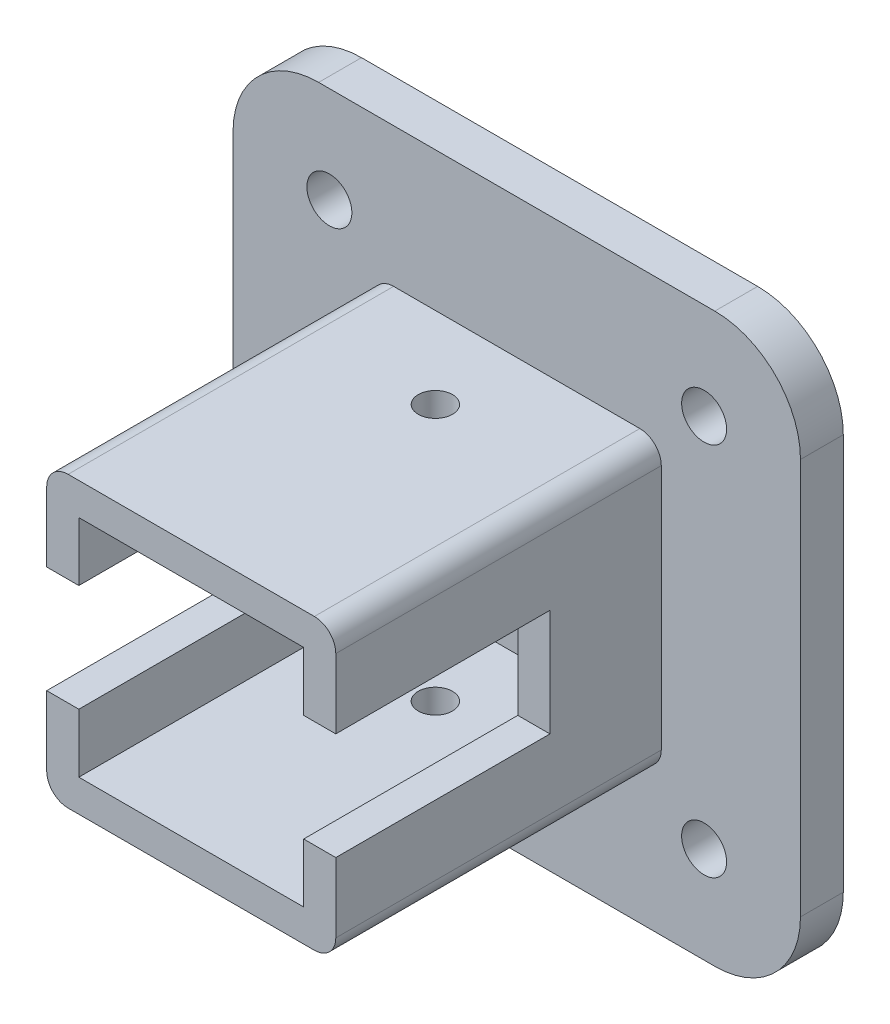
ISO-10303-21;
HEADER;
FILE_DESCRIPTION(('STEP AP214'),'2;1');
FILE_NAME('part.step','',(''),(''),'','','');
FILE_SCHEMA(('AUTOMOTIVE_DESIGN { 1 0 10303 214 1 1 1 1 }'));
ENDSEC;
DATA;
#1=APPLICATION_CONTEXT('core data for automotive mechanical design processes');
#2=APPLICATION_PROTOCOL_DEFINITION('international standard','automotive_design',2000,#1);
#3=PRODUCT_CONTEXT('',#1,'mechanical');
#4=PRODUCT('Part','Part','',(#3));
#5=PRODUCT_RELATED_PRODUCT_CATEGORY('part','',(#4));
#6=PRODUCT_DEFINITION_FORMATION('','',#4);
#7=PRODUCT_DEFINITION_CONTEXT('part definition',#1,'design');
#8=PRODUCT_DEFINITION('design','',#6,#7);
#9=PRODUCT_DEFINITION_SHAPE('','',#8);
#10=(LENGTH_UNIT() NAMED_UNIT(*) SI_UNIT(.MILLI.,.METRE.));
#11=(NAMED_UNIT(*) PLANE_ANGLE_UNIT() SI_UNIT($,.RADIAN.));
#12=(NAMED_UNIT(*) SI_UNIT($,.STERADIAN.) SOLID_ANGLE_UNIT());
#13=UNCERTAINTY_MEASURE_WITH_UNIT(LENGTH_MEASURE(1.E-05),#10,'distance_accuracy_value','');
#14=(GEOMETRIC_REPRESENTATION_CONTEXT(3) GLOBAL_UNCERTAINTY_ASSIGNED_CONTEXT((#13)) GLOBAL_UNIT_ASSIGNED_CONTEXT((#10,
#11,#12)) REPRESENTATION_CONTEXT('',''));
#15=CARTESIAN_POINT('',(0.,0.,0.));
#16=DIRECTION('',(0.,0.,1.));
#17=DIRECTION('',(1.,0.,0.));
#18=AXIS2_PLACEMENT_3D('',#15,#16,#17);
#19=CARTESIAN_POINT('',(0.,0.,30.4));
#20=DIRECTION('',(0.,0.,1.));
#21=DIRECTION('',(1.,0.,0.));
#22=AXIS2_PLACEMENT_3D('',#19,#20,#21);
#23=PLANE('',#22);
#24=DIRECTION('',(-1.,0.,0.));
#25=VECTOR('',#24,1.);
#26=CARTESIAN_POINT('',(0.,5.,30.4));
#27=LINE('',#26,#25);
#28=CARTESIAN_POINT('',(13.5,5.,30.4));
#29=VERTEX_POINT('',#28);
#30=CARTESIAN_POINT('',(10.5,5.,30.4));
#31=VERTEX_POINT('',#30);
#32=EDGE_CURVE('E45',#29,#31,#27,.T.);
#33=ORIENTED_EDGE('',*,*,#32,.F.);
#34=DIRECTION('',(0.,1.,0.));
#35=VECTOR('',#34,1.);
#36=CARTESIAN_POINT('',(13.5,0.,30.4));
#37=LINE('',#36,#35);
#38=CARTESIAN_POINT('',(13.5,11.5,30.4));
#39=VERTEX_POINT('',#38);
#40=EDGE_CURVE('E248',#29,#39,#37,.T.);
#41=ORIENTED_EDGE('',*,*,#40,.T.);
#42=CARTESIAN_POINT('',(11.5,11.5,30.4));
#43=DIRECTION('',(0.,0.,1.));
#44=DIRECTION('',(1.,0.,0.));
#45=AXIS2_PLACEMENT_3D('',#42,#43,#44);
#46=CIRCLE('',#45,2.);
#47=CARTESIAN_POINT('',(11.5,13.5,30.4));
#48=VERTEX_POINT('',#47);
#49=EDGE_CURVE('E247',#39,#48,#46,.T.);
#50=ORIENTED_EDGE('',*,*,#49,.T.);
#51=DIRECTION('',(-1.,0.,0.));
#52=VECTOR('',#51,1.);
#53=CARTESIAN_POINT('',(0.,13.5,30.4));
#54=LINE('',#53,#52);
#55=CARTESIAN_POINT('',(-11.5,13.5,30.4));
#56=VERTEX_POINT('',#55);
#57=EDGE_CURVE('E251',#48,#56,#54,.T.);
#58=ORIENTED_EDGE('',*,*,#57,.T.);
#59=CARTESIAN_POINT('',(-11.5,11.5,30.4));
#60=DIRECTION('',(0.,0.,1.));
#61=DIRECTION('',(1.,0.,0.));
#62=AXIS2_PLACEMENT_3D('',#59,#60,#61);
#63=CIRCLE('',#62,2.);
#64=CARTESIAN_POINT('',(-13.5,11.5,30.4));
#65=VERTEX_POINT('',#64);
#66=EDGE_CURVE('E443',#56,#65,#63,.T.);
#67=ORIENTED_EDGE('',*,*,#66,.T.);
#68=DIRECTION('',(0.,-1.,0.));
#69=VECTOR('',#68,1.);
#70=CARTESIAN_POINT('',(-13.5,0.,30.4));
#71=LINE('',#70,#69);
#72=CARTESIAN_POINT('',(-13.5,5.,30.4));
#73=VERTEX_POINT('',#72);
#74=EDGE_CURVE('E451',#65,#73,#71,.T.);
#75=ORIENTED_EDGE('',*,*,#74,.T.);
#76=CARTESIAN_POINT('',(-10.5,5.,30.4));
#77=VERTEX_POINT('',#76);
#78=EDGE_CURVE('E418',#77,#73,#27,.T.);
#79=ORIENTED_EDGE('',*,*,#78,.F.);
#80=DIRECTION('',(0.,1.,0.));
#81=VECTOR('',#80,1.);
#82=CARTESIAN_POINT('',(-10.5,0.,30.4));
#83=LINE('',#82,#81);
#84=CARTESIAN_POINT('',(-10.5,10.5,30.4));
#85=VERTEX_POINT('',#84);
#86=EDGE_CURVE('E440',#77,#85,#83,.T.);
#87=ORIENTED_EDGE('',*,*,#86,.T.);
#88=DIRECTION('',(1.,0.,0.));
#89=VECTOR('',#88,1.);
#90=CARTESIAN_POINT('',(0.,10.5,30.4));
#91=LINE('',#90,#89);
#92=CARTESIAN_POINT('',(10.5,10.5,30.4));
#93=VERTEX_POINT('',#92);
#94=EDGE_CURVE('E439',#85,#93,#91,.T.);
#95=ORIENTED_EDGE('',*,*,#94,.T.);
#96=DIRECTION('',(0.,-1.,0.));
#97=VECTOR('',#96,1.);
#98=CARTESIAN_POINT('',(10.5,0.,30.4));
#99=LINE('',#98,#97);
#100=EDGE_CURVE('E497',#93,#31,#99,.T.);
#101=ORIENTED_EDGE('',*,*,#100,.T.);
#102=EDGE_LOOP('',(#33,#41,#50,#58,#67,#75,#79,#87,#95,#101));
#103=FACE_BOUND('',#102,.T.);
#104=ADVANCED_FACE('F37',(#103),#23,.T.);
#105=CARTESIAN_POINT('',(13.5,-13.5,15.2));
#106=DIRECTION('',(-1.,0.,0.));
#107=DIRECTION('',(0.,0.,1.));
#108=AXIS2_PLACEMENT_3D('',#105,#106,#107);
#109=PLANE('',#108);
#110=ORIENTED_EDGE('',*,*,#40,.F.);
#111=DIRECTION('',(0.,0.,1.));
#112=VECTOR('',#111,1.);
#113=CARTESIAN_POINT('',(13.5,5.,30.4));
#114=LINE('',#113,#112);
#115=CARTESIAN_POINT('',(13.5,5.,10.4));
#116=VERTEX_POINT('',#115);
#117=EDGE_CURVE('E518',#116,#29,#114,.T.);
#118=ORIENTED_EDGE('',*,*,#117,.F.);
#119=DIRECTION('',(0.,1.,0.));
#120=VECTOR('',#119,1.);
#121=CARTESIAN_POINT('',(13.5,5.,10.4));
#122=LINE('',#121,#120);
#123=CARTESIAN_POINT('',(13.5,-5.,10.4));
#124=VERTEX_POINT('',#123);
#125=EDGE_CURVE('E240',#124,#116,#122,.T.);
#126=ORIENTED_EDGE('',*,*,#125,.F.);
#127=DIRECTION('',(0.,0.,-1.));
#128=VECTOR('',#127,1.);
#129=CARTESIAN_POINT('',(13.5,-5.,30.4));
#130=LINE('',#129,#128);
#131=CARTESIAN_POINT('',(13.5,-5.,30.4));
#132=VERTEX_POINT('',#131);
#133=EDGE_CURVE('E224',#132,#124,#130,.T.);
#134=ORIENTED_EDGE('',*,*,#133,.F.);
#135=CARTESIAN_POINT('',(13.5,-11.5,30.4));
#136=VERTEX_POINT('',#135);
#137=EDGE_CURVE('E237',#136,#132,#37,.T.);
#138=ORIENTED_EDGE('',*,*,#137,.F.);
#139=DIRECTION('',(0.,0.,-1.));
#140=VECTOR('',#139,1.);
#141=CARTESIAN_POINT('',(13.5,-11.5,15.2));
#142=LINE('',#141,#140);
#143=CARTESIAN_POINT('',(13.5,-11.5,0.));
#144=VERTEX_POINT('',#143);
#145=EDGE_CURVE('E407',#136,#144,#142,.T.);
#146=ORIENTED_EDGE('',*,*,#145,.T.);
#147=DIRECTION('',(0.,1.,0.));
#148=VECTOR('',#147,1.);
#149=CARTESIAN_POINT('',(13.5,-13.5,0.));
#150=LINE('',#149,#148);
#151=CARTESIAN_POINT('',(13.5,11.5,0.));
#152=VERTEX_POINT('',#151);
#153=EDGE_CURVE('E377',#144,#152,#150,.T.);
#154=ORIENTED_EDGE('',*,*,#153,.T.);
#155=DIRECTION('',(0.,0.,-1.));
#156=VECTOR('',#155,1.);
#157=CARTESIAN_POINT('',(13.5,11.5,15.2));
#158=LINE('',#157,#156);
#159=EDGE_CURVE('E409',#152,#39,#158,.F.);
#160=ORIENTED_EDGE('',*,*,#159,.T.);
#161=EDGE_LOOP('',(#110,#118,#126,#134,#138,#146,#154,#160));
#162=FACE_BOUND('',#161,.T.);
#163=ADVANCED_FACE('F235',(#162),#109,.F.);
#164=CARTESIAN_POINT('',(13.5,13.5,15.2));
#165=DIRECTION('',(0.,-1.,0.));
#166=DIRECTION('',(1.,0.,0.));
#167=AXIS2_PLACEMENT_3D('',#164,#165,#166);
#168=PLANE('',#167);
#169=CARTESIAN_POINT('',(0.,13.5,7.6));
#170=DIRECTION('',(0.,-1.,0.));
#171=DIRECTION('',(1.,0.,0.));
#172=AXIS2_PLACEMENT_3D('',#169,#170,#171);
#173=CIRCLE('',#172,1.6);
#174=CARTESIAN_POINT('',(1.6,13.5,7.6));
#175=VERTEX_POINT('',#174);
#176=EDGE_CURVE('E347',#175,#175,#173,.T.);
#177=ORIENTED_EDGE('',*,*,#176,.T.);
#178=EDGE_LOOP('',(#177));
#179=FACE_BOUND('',#178,.T.);
#180=DIRECTION('',(-1.,0.,0.));
#181=VECTOR('',#180,1.);
#182=CARTESIAN_POINT('',(13.5,13.5,0.));
#183=LINE('',#182,#181);
#184=CARTESIAN_POINT('',(11.5,13.5,0.));
#185=VERTEX_POINT('',#184);
#186=CARTESIAN_POINT('',(-11.5,13.5,0.));
#187=VERTEX_POINT('',#186);
#188=EDGE_CURVE('E380',#185,#187,#183,.T.);
#189=ORIENTED_EDGE('',*,*,#188,.T.);
#190=DIRECTION('',(0.,0.,-1.));
#191=VECTOR('',#190,1.);
#192=CARTESIAN_POINT('',(-11.5,13.5,15.2));
#193=LINE('',#192,#191);
#194=EDGE_CURVE('E405',#187,#56,#193,.F.);
#195=ORIENTED_EDGE('',*,*,#194,.T.);
#196=ORIENTED_EDGE('',*,*,#57,.F.);
#197=DIRECTION('',(0.,0.,-1.));
#198=VECTOR('',#197,1.);
#199=CARTESIAN_POINT('',(11.5,13.5,15.2));
#200=LINE('',#199,#198);
#201=EDGE_CURVE('E402',#48,#185,#200,.T.);
#202=ORIENTED_EDGE('',*,*,#201,.T.);
#203=EDGE_LOOP('',(#189,#195,#196,#202));
#204=FACE_BOUND('',#203,.T.);
#205=ADVANCED_FACE('F474',(#179,#204),#168,.F.);
#206=CARTESIAN_POINT('',(-13.5,-13.5,15.2));
#207=DIRECTION('',(1.,0.,0.));
#208=DIRECTION('',(0.,0.,-1.));
#209=AXIS2_PLACEMENT_3D('',#206,#207,#208);
#210=PLANE('',#209);
#211=DIRECTION('',(0.,1.,0.));
#212=VECTOR('',#211,1.);
#213=CARTESIAN_POINT('',(-13.5,-13.5,10.4));
#214=LINE('',#213,#212);
#215=CARTESIAN_POINT('',(-13.5,-5.,10.4));
#216=VERTEX_POINT('',#215);
#217=CARTESIAN_POINT('',(-13.5,5.,10.4));
#218=VERTEX_POINT('',#217);
#219=EDGE_CURVE('E505',#216,#218,#214,.T.);
#220=ORIENTED_EDGE('',*,*,#219,.T.);
#221=DIRECTION('',(0.,0.,1.));
#222=VECTOR('',#221,1.);
#223=CARTESIAN_POINT('',(-13.5,5.,15.2));
#224=LINE('',#223,#222);
#225=EDGE_CURVE('E486',#218,#73,#224,.T.);
#226=ORIENTED_EDGE('',*,*,#225,.T.);
#227=ORIENTED_EDGE('',*,*,#74,.F.);
#228=DIRECTION('',(0.,0.,-1.));
#229=VECTOR('',#228,1.);
#230=CARTESIAN_POINT('',(-13.5,11.5,15.2));
#231=LINE('',#230,#229);
#232=CARTESIAN_POINT('',(-13.5,11.5,0.));
#233=VERTEX_POINT('',#232);
#234=EDGE_CURVE('E396',#65,#233,#231,.T.);
#235=ORIENTED_EDGE('',*,*,#234,.T.);
#236=DIRECTION('',(0.,-1.,0.));
#237=VECTOR('',#236,1.);
#238=CARTESIAN_POINT('',(-13.5,-13.5,0.));
#239=LINE('',#238,#237);
#240=CARTESIAN_POINT('',(-13.5,-11.5,0.));
#241=VERTEX_POINT('',#240);
#242=EDGE_CURVE('E383',#233,#241,#239,.T.);
#243=ORIENTED_EDGE('',*,*,#242,.T.);
#244=DIRECTION('',(0.,0.,-1.));
#245=VECTOR('',#244,1.);
#246=CARTESIAN_POINT('',(-13.5,-11.5,15.2));
#247=LINE('',#246,#245);
#248=CARTESIAN_POINT('',(-13.5,-11.5,30.4));
#249=VERTEX_POINT('',#248);
#250=EDGE_CURVE('E399',#241,#249,#247,.F.);
#251=ORIENTED_EDGE('',*,*,#250,.T.);
#252=CARTESIAN_POINT('',(-13.5,-5.,30.4));
#253=VERTEX_POINT('',#252);
#254=EDGE_CURVE('E450',#253,#249,#71,.T.);
#255=ORIENTED_EDGE('',*,*,#254,.F.);
#256=DIRECTION('',(0.,0.,-1.));
#257=VECTOR('',#256,1.);
#258=CARTESIAN_POINT('',(-13.5,-5.,15.2));
#259=LINE('',#258,#257);
#260=EDGE_CURVE('E52',#253,#216,#259,.T.);
#261=ORIENTED_EDGE('',*,*,#260,.T.);
#262=EDGE_LOOP('',(#220,#226,#227,#235,#243,#251,#255,#261));
#263=FACE_BOUND('',#262,.T.);
#264=ADVANCED_FACE('F485',(#263),#210,.F.);
#265=CARTESIAN_POINT('',(13.5,-13.5,15.2));
#266=DIRECTION('',(0.,1.,0.));
#267=DIRECTION('',(-1.,0.,0.));
#268=AXIS2_PLACEMENT_3D('',#265,#266,#267);
#269=PLANE('',#268);
#270=CARTESIAN_POINT('',(0.,-13.5,7.6));
#271=DIRECTION('',(0.,-1.,0.));
#272=DIRECTION('',(1.,0.,0.));
#273=AXIS2_PLACEMENT_3D('',#270,#271,#272);
#274=CIRCLE('',#273,1.6);
#275=CARTESIAN_POINT('',(1.6,-13.5,7.6));
#276=VERTEX_POINT('',#275);
#277=EDGE_CURVE('E336',#276,#276,#274,.T.);
#278=ORIENTED_EDGE('',*,*,#277,.F.);
#279=EDGE_LOOP('',(#278));
#280=FACE_BOUND('',#279,.T.);
#281=DIRECTION('',(0.,0.,-1.));
#282=VECTOR('',#281,1.);
#283=CARTESIAN_POINT('',(11.5,-13.5,15.2));
#284=LINE('',#283,#282);
#285=CARTESIAN_POINT('',(11.5,-13.5,0.));
#286=VERTEX_POINT('',#285);
#287=CARTESIAN_POINT('',(11.5,-13.5,30.4));
#288=VERTEX_POINT('',#287);
#289=EDGE_CURVE('E389',#286,#288,#284,.F.);
#290=ORIENTED_EDGE('',*,*,#289,.T.);
#291=DIRECTION('',(1.,0.,0.));
#292=VECTOR('',#291,1.);
#293=CARTESIAN_POINT('',(0.,-13.5,30.4));
#294=LINE('',#293,#292);
#295=CARTESIAN_POINT('',(-11.5,-13.5,30.4));
#296=VERTEX_POINT('',#295);
#297=EDGE_CURVE('E456',#296,#288,#294,.T.);
#298=ORIENTED_EDGE('',*,*,#297,.F.);
#299=DIRECTION('',(0.,0.,-1.));
#300=VECTOR('',#299,1.);
#301=CARTESIAN_POINT('',(-11.5,-13.5,15.2));
#302=LINE('',#301,#300);
#303=CARTESIAN_POINT('',(-11.5,-13.5,0.));
#304=VERTEX_POINT('',#303);
#305=EDGE_CURVE('E393',#296,#304,#302,.T.);
#306=ORIENTED_EDGE('',*,*,#305,.T.);
#307=DIRECTION('',(1.,0.,0.));
#308=VECTOR('',#307,1.);
#309=CARTESIAN_POINT('',(13.5,-13.5,0.));
#310=LINE('',#309,#308);
#311=EDGE_CURVE('E386',#304,#286,#310,.T.);
#312=ORIENTED_EDGE('',*,*,#311,.T.);
#313=EDGE_LOOP('',(#290,#298,#306,#312));
#314=FACE_BOUND('',#313,.T.);
#315=ADVANCED_FACE('F623',(#280,#314),#269,.F.);
#316=CARTESIAN_POINT('',(-10.5,-10.5,15.2));
#317=DIRECTION('',(1.,0.,0.));
#318=DIRECTION('',(0.,0.,-1.));
#319=AXIS2_PLACEMENT_3D('',#316,#317,#318);
#320=PLANE('',#319);
#321=DIRECTION('',(0.,0.,1.));
#322=VECTOR('',#321,1.);
#323=CARTESIAN_POINT('',(-10.5,5.,15.2));
#324=LINE('',#323,#322);
#325=CARTESIAN_POINT('',(-10.5,5.,10.4));
#326=VERTEX_POINT('',#325);
#327=EDGE_CURVE('E489',#326,#77,#324,.T.);
#328=ORIENTED_EDGE('',*,*,#327,.F.);
#329=DIRECTION('',(0.,1.,0.));
#330=VECTOR('',#329,1.);
#331=CARTESIAN_POINT('',(-10.5,-10.5,10.4));
#332=LINE('',#331,#330);
#333=CARTESIAN_POINT('',(-10.5,-5.,10.4));
#334=VERTEX_POINT('',#333);
#335=EDGE_CURVE('E434',#334,#326,#332,.T.);
#336=ORIENTED_EDGE('',*,*,#335,.F.);
#337=DIRECTION('',(0.,0.,-1.));
#338=VECTOR('',#337,1.);
#339=CARTESIAN_POINT('',(-10.5,-5.,15.2));
#340=LINE('',#339,#338);
#341=CARTESIAN_POINT('',(-10.5,-5.,30.4));
#342=VERTEX_POINT('',#341);
#343=EDGE_CURVE('E424',#342,#334,#340,.T.);
#344=ORIENTED_EDGE('',*,*,#343,.F.);
#345=CARTESIAN_POINT('',(-10.5,-10.5,30.4));
#346=VERTEX_POINT('',#345);
#347=EDGE_CURVE('E433',#346,#342,#83,.T.);
#348=ORIENTED_EDGE('',*,*,#347,.F.);
#349=DIRECTION('',(0.,0.,-1.));
#350=VECTOR('',#349,1.);
#351=CARTESIAN_POINT('',(-10.5,-10.5,15.2));
#352=LINE('',#351,#350);
#353=CARTESIAN_POINT('',(-10.5,-10.5,0.));
#354=VERTEX_POINT('',#353);
#355=EDGE_CURVE('E374',#346,#354,#352,.T.);
#356=ORIENTED_EDGE('',*,*,#355,.T.);
#357=DIRECTION('',(0.,-1.,0.));
#358=VECTOR('',#357,1.);
#359=CARTESIAN_POINT('',(-10.5,-10.5,0.));
#360=LINE('',#359,#358);
#361=CARTESIAN_POINT('',(-10.5,10.5,0.));
#362=VERTEX_POINT('',#361);
#363=EDGE_CURVE('E356',#362,#354,#360,.T.);
#364=ORIENTED_EDGE('',*,*,#363,.F.);
#365=DIRECTION('',(0.,0.,-1.));
#366=VECTOR('',#365,1.);
#367=CARTESIAN_POINT('',(-10.5,10.5,15.2));
#368=LINE('',#367,#366);
#369=EDGE_CURVE('E368',#85,#362,#368,.T.);
#370=ORIENTED_EDGE('',*,*,#369,.F.);
#371=ORIENTED_EDGE('',*,*,#86,.F.);
#372=EDGE_LOOP('',(#328,#336,#344,#348,#356,#364,#370,#371));
#373=FACE_BOUND('',#372,.T.);
#374=ADVANCED_FACE('F432',(#373),#320,.T.);
#375=CARTESIAN_POINT('',(10.5,-10.5,15.2));
#376=DIRECTION('',(0.,1.,0.));
#377=DIRECTION('',(-1.,0.,0.));
#378=AXIS2_PLACEMENT_3D('',#375,#376,#377);
#379=PLANE('',#378);
#380=CARTESIAN_POINT('',(0.,-10.5,7.6));
#381=DIRECTION('',(0.,1.,0.));
#382=DIRECTION('',(-1.,0.,0.));
#383=AXIS2_PLACEMENT_3D('',#380,#381,#382);
#384=CIRCLE('',#383,1.6);
#385=CARTESIAN_POINT('',(-1.6,-10.5,7.6));
#386=VERTEX_POINT('',#385);
#387=EDGE_CURVE('E353',#386,#386,#384,.T.);
#388=ORIENTED_EDGE('',*,*,#387,.F.);
#389=EDGE_LOOP('',(#388));
#390=FACE_BOUND('',#389,.T.);
#391=DIRECTION('',(1.,0.,0.));
#392=VECTOR('',#391,1.);
#393=CARTESIAN_POINT('',(10.5,-10.5,0.));
#394=LINE('',#393,#392);
#395=CARTESIAN_POINT('',(10.5,-10.5,0.));
#396=VERTEX_POINT('',#395);
#397=EDGE_CURVE('E359',#354,#396,#394,.T.);
#398=ORIENTED_EDGE('',*,*,#397,.F.);
#399=ORIENTED_EDGE('',*,*,#355,.F.);
#400=DIRECTION('',(-1.,0.,0.));
#401=VECTOR('',#400,1.);
#402=CARTESIAN_POINT('',(0.,-10.5,30.4));
#403=LINE('',#402,#401);
#404=CARTESIAN_POINT('',(10.5,-10.5,30.4));
#405=VERTEX_POINT('',#404);
#406=EDGE_CURVE('E438',#405,#346,#403,.T.);
#407=ORIENTED_EDGE('',*,*,#406,.F.);
#408=DIRECTION('',(0.,0.,-1.));
#409=VECTOR('',#408,1.);
#410=CARTESIAN_POINT('',(10.5,-10.5,15.2));
#411=LINE('',#410,#409);
#412=EDGE_CURVE('E372',#405,#396,#411,.T.);
#413=ORIENTED_EDGE('',*,*,#412,.T.);
#414=EDGE_LOOP('',(#398,#399,#407,#413));
#415=FACE_BOUND('',#414,.T.);
#416=ADVANCED_FACE('F617',(#390,#415),#379,.T.);
#417=CARTESIAN_POINT('',(10.5,-10.5,15.2));
#418=DIRECTION('',(-1.,0.,0.));
#419=DIRECTION('',(0.,0.,1.));
#420=AXIS2_PLACEMENT_3D('',#417,#418,#419);
#421=PLANE('',#420);
#422=DIRECTION('',(0.,0.,-1.));
#423=VECTOR('',#422,1.);
#424=CARTESIAN_POINT('',(10.5,5.,15.2));
#425=LINE('',#424,#423);
#426=CARTESIAN_POINT('',(10.5,5.,10.4));
#427=VERTEX_POINT('',#426);
#428=EDGE_CURVE('E503',#31,#427,#425,.T.);
#429=ORIENTED_EDGE('',*,*,#428,.F.);
#430=ORIENTED_EDGE('',*,*,#100,.F.);
#431=DIRECTION('',(0.,0.,-1.));
#432=VECTOR('',#431,1.);
#433=CARTESIAN_POINT('',(10.5,10.5,15.2));
#434=LINE('',#433,#432);
#435=CARTESIAN_POINT('',(10.5,10.5,0.));
#436=VERTEX_POINT('',#435);
#437=EDGE_CURVE('E370',#93,#436,#434,.T.);
#438=ORIENTED_EDGE('',*,*,#437,.T.);
#439=DIRECTION('',(0.,1.,0.));
#440=VECTOR('',#439,1.);
#441=CARTESIAN_POINT('',(10.5,-10.5,0.));
#442=LINE('',#441,#440);
#443=EDGE_CURVE('E362',#396,#436,#442,.T.);
#444=ORIENTED_EDGE('',*,*,#443,.F.);
#445=ORIENTED_EDGE('',*,*,#412,.F.);
#446=CARTESIAN_POINT('',(10.5,-5.,30.4));
#447=VERTEX_POINT('',#446);
#448=EDGE_CURVE('E504',#447,#405,#99,.T.);
#449=ORIENTED_EDGE('',*,*,#448,.F.);
#450=DIRECTION('',(0.,0.,1.));
#451=VECTOR('',#450,1.);
#452=CARTESIAN_POINT('',(10.5,-5.,15.2));
#453=LINE('',#452,#451);
#454=CARTESIAN_POINT('',(10.5,-5.,10.4));
#455=VERTEX_POINT('',#454);
#456=EDGE_CURVE('E60',#455,#447,#453,.T.);
#457=ORIENTED_EDGE('',*,*,#456,.F.);
#458=DIRECTION('',(0.,-1.,0.));
#459=VECTOR('',#458,1.);
#460=CARTESIAN_POINT('',(10.5,-10.5,10.4));
#461=LINE('',#460,#459);
#462=EDGE_CURVE('E11',#427,#455,#461,.T.);
#463=ORIENTED_EDGE('',*,*,#462,.F.);
#464=EDGE_LOOP('',(#429,#430,#438,#444,#445,#449,#457,#463));
#465=FACE_BOUND('',#464,.T.);
#466=ADVANCED_FACE('F500',(#465),#421,.T.);
#467=CARTESIAN_POINT('',(10.5,10.5,15.2));
#468=DIRECTION('',(0.,-1.,0.));
#469=DIRECTION('',(1.,0.,0.));
#470=AXIS2_PLACEMENT_3D('',#467,#468,#469);
#471=PLANE('',#470);
#472=CARTESIAN_POINT('',(0.,10.5,7.6));
#473=DIRECTION('',(0.,-1.,0.));
#474=DIRECTION('',(1.,0.,0.));
#475=AXIS2_PLACEMENT_3D('',#472,#473,#474);
#476=CIRCLE('',#475,1.6);
#477=CARTESIAN_POINT('',(1.6,10.5,7.6));
#478=VERTEX_POINT('',#477);
#479=EDGE_CURVE('E350',#478,#478,#476,.T.);
#480=ORIENTED_EDGE('',*,*,#479,.F.);
#481=EDGE_LOOP('',(#480));
#482=FACE_BOUND('',#481,.T.);
#483=DIRECTION('',(-1.,0.,0.));
#484=VECTOR('',#483,1.);
#485=CARTESIAN_POINT('',(10.5,10.5,0.));
#486=LINE('',#485,#484);
#487=EDGE_CURVE('E365',#436,#362,#486,.T.);
#488=ORIENTED_EDGE('',*,*,#487,.F.);
#489=ORIENTED_EDGE('',*,*,#437,.F.);
#490=ORIENTED_EDGE('',*,*,#94,.F.);
#491=ORIENTED_EDGE('',*,*,#369,.T.);
#492=EDGE_LOOP('',(#488,#489,#490,#491));
#493=FACE_BOUND('',#492,.T.);
#494=ADVANCED_FACE('F494',(#482,#493),#471,.T.);
#495=CARTESIAN_POINT('',(0.,13.5,7.6));
#496=DIRECTION('',(0.,-1.,0.));
#497=DIRECTION('',(1.,0.,0.));
#498=AXIS2_PLACEMENT_3D('',#495,#496,#497);
#499=CYLINDRICAL_SURFACE('',#498,1.6);
#500=ORIENTED_EDGE('',*,*,#479,.T.);
#501=EDGE_LOOP('',(#500));
#502=FACE_BOUND('',#501,.T.);
#503=ORIENTED_EDGE('',*,*,#176,.F.);
#504=EDGE_LOOP('',(#503));
#505=FACE_BOUND('',#504,.T.);
#506=ADVANCED_FACE('F607',(#502,#505),#499,.F.);
#507=ORIENTED_EDGE('',*,*,#387,.T.);
#508=EDGE_LOOP('',(#507));
#509=FACE_BOUND('',#508,.T.);
#510=ORIENTED_EDGE('',*,*,#277,.T.);
#511=EDGE_LOOP('',(#510));
#512=FACE_BOUND('',#511,.T.);
#513=ADVANCED_FACE('F610',(#509,#512),#499,.F.);
#514=CARTESIAN_POINT('',(0.,0.,0.));
#515=DIRECTION('',(0.,0.,-1.));
#516=DIRECTION('',(-1.,0.,0.));
#517=AXIS2_PLACEMENT_3D('',#514,#515,#516);
#518=PLANE('',#517);
#519=ORIENTED_EDGE('',*,*,#487,.T.);
#520=ORIENTED_EDGE('',*,*,#363,.T.);
#521=ORIENTED_EDGE('',*,*,#397,.T.);
#522=ORIENTED_EDGE('',*,*,#443,.T.);
#523=EDGE_LOOP('',(#519,#520,#521,#522));
#524=FACE_BOUND('',#523,.T.);
#525=ADVANCED_FACE('F591',(#524),#518,.F.);
#526=CARTESIAN_POINT('',(-17.5,17.5,-4.));
#527=DIRECTION('',(0.,0.,1.));
#528=DIRECTION('',(1.,0.,0.));
#529=AXIS2_PLACEMENT_3D('',#526,#527,#528);
#530=CYLINDRICAL_SURFACE('',#529,2.1);
#531=CARTESIAN_POINT('',(-17.5,17.5,-4.));
#532=DIRECTION('',(0.,0.,-1.));
#533=DIRECTION('',(-1.,0.,0.));
#534=AXIS2_PLACEMENT_3D('',#531,#532,#533);
#535=CIRCLE('',#534,2.1);
#536=CARTESIAN_POINT('',(-19.6,17.5,-4.));
#537=VERTEX_POINT('',#536);
#538=EDGE_CURVE('E333',#537,#537,#535,.T.);
#539=ORIENTED_EDGE('',*,*,#538,.T.);
#540=EDGE_LOOP('',(#539));
#541=FACE_BOUND('',#540,.T.);
#542=CARTESIAN_POINT('',(-17.5,17.5,0.));
#543=DIRECTION('',(0.,0.,-1.));
#544=DIRECTION('',(-1.,0.,0.));
#545=AXIS2_PLACEMENT_3D('',#542,#543,#544);
#546=CIRCLE('',#545,2.1);
#547=CARTESIAN_POINT('',(-19.6,17.5,0.));
#548=VERTEX_POINT('',#547);
#549=EDGE_CURVE('E327',#548,#548,#546,.T.);
#550=ORIENTED_EDGE('',*,*,#549,.F.);
#551=EDGE_LOOP('',(#550));
#552=FACE_BOUND('',#551,.T.);
#553=ADVANCED_FACE('F592',(#541,#552),#530,.F.);
#554=CARTESIAN_POINT('',(-17.5,-17.5,-4.));
#555=DIRECTION('',(0.,0.,1.));
#556=DIRECTION('',(1.,0.,0.));
#557=AXIS2_PLACEMENT_3D('',#554,#555,#556);
#558=CYLINDRICAL_SURFACE('',#557,2.1);
#559=CARTESIAN_POINT('',(-17.5,-17.5,-4.));
#560=DIRECTION('',(0.,0.,-1.));
#561=DIRECTION('',(-1.,0.,0.));
#562=AXIS2_PLACEMENT_3D('',#559,#560,#561);
#563=CIRCLE('',#562,2.1);
#564=CARTESIAN_POINT('',(-19.6,-17.5,-4.));
#565=VERTEX_POINT('',#564);
#566=EDGE_CURVE('E330',#565,#565,#563,.T.);
#567=ORIENTED_EDGE('',*,*,#566,.T.);
#568=EDGE_LOOP('',(#567));
#569=FACE_BOUND('',#568,.T.);
#570=CARTESIAN_POINT('',(-17.5,-17.5,0.));
#571=DIRECTION('',(0.,0.,-1.));
#572=DIRECTION('',(-1.,0.,0.));
#573=AXIS2_PLACEMENT_3D('',#570,#571,#572);
#574=CIRCLE('',#573,2.1);
#575=CARTESIAN_POINT('',(-19.6,-17.5,0.));
#576=VERTEX_POINT('',#575);
#577=EDGE_CURVE('E342',#576,#576,#574,.T.);
#578=ORIENTED_EDGE('',*,*,#577,.F.);
#579=EDGE_LOOP('',(#578));
#580=FACE_BOUND('',#579,.T.);
#581=ADVANCED_FACE('F595',(#569,#580),#558,.F.);
#582=CARTESIAN_POINT('',(17.5,-17.5,-4.));
#583=DIRECTION('',(0.,0.,1.));
#584=DIRECTION('',(1.,0.,0.));
#585=AXIS2_PLACEMENT_3D('',#582,#583,#584);
#586=CYLINDRICAL_SURFACE('',#585,2.1);
#587=CARTESIAN_POINT('',(17.5,-17.5,-4.));
#588=DIRECTION('',(0.,0.,-1.));
#589=DIRECTION('',(-1.,0.,0.));
#590=AXIS2_PLACEMENT_3D('',#587,#588,#589);
#591=CIRCLE('',#590,2.1);
#592=CARTESIAN_POINT('',(15.4,-17.5,-4.));
#593=VERTEX_POINT('',#592);
#594=EDGE_CURVE('E326',#593,#593,#591,.T.);
#595=ORIENTED_EDGE('',*,*,#594,.T.);
#596=EDGE_LOOP('',(#595));
#597=FACE_BOUND('',#596,.T.);
#598=CARTESIAN_POINT('',(17.5,-17.5,0.));
#599=DIRECTION('',(0.,0.,-1.));
#600=DIRECTION('',(-1.,0.,0.));
#601=AXIS2_PLACEMENT_3D('',#598,#599,#600);
#602=CIRCLE('',#601,2.1);
#603=CARTESIAN_POINT('',(15.4,-17.5,0.));
#604=VERTEX_POINT('',#603);
#605=EDGE_CURVE('E339',#604,#604,#602,.T.);
#606=ORIENTED_EDGE('',*,*,#605,.F.);
#607=EDGE_LOOP('',(#606));
#608=FACE_BOUND('',#607,.T.);
#609=ADVANCED_FACE('F599',(#597,#608),#586,.F.);
#610=CARTESIAN_POINT('',(17.5,17.5,-4.));
#611=DIRECTION('',(0.,0.,1.));
#612=DIRECTION('',(1.,0.,0.));
#613=AXIS2_PLACEMENT_3D('',#610,#611,#612);
#614=CYLINDRICAL_SURFACE('',#613,2.1);
#615=CARTESIAN_POINT('',(17.5,17.5,-4.));
#616=DIRECTION('',(0.,0.,-1.));
#617=DIRECTION('',(-1.,0.,0.));
#618=AXIS2_PLACEMENT_3D('',#615,#616,#617);
#619=CIRCLE('',#618,2.1);
#620=CARTESIAN_POINT('',(15.4,17.5,-4.));
#621=VERTEX_POINT('',#620);
#622=EDGE_CURVE('E323',#621,#621,#619,.T.);
#623=ORIENTED_EDGE('',*,*,#622,.T.);
#624=EDGE_LOOP('',(#623));
#625=FACE_BOUND('',#624,.T.);
#626=CARTESIAN_POINT('',(17.5,17.5,0.));
#627=DIRECTION('',(0.,0.,-1.));
#628=DIRECTION('',(-1.,0.,0.));
#629=AXIS2_PLACEMENT_3D('',#626,#627,#628);
#630=CIRCLE('',#629,2.1);
#631=CARTESIAN_POINT('',(15.4,17.5,0.));
#632=VERTEX_POINT('',#631);
#633=EDGE_CURVE('E262',#632,#632,#630,.T.);
#634=ORIENTED_EDGE('',*,*,#633,.F.);
#635=EDGE_LOOP('',(#634));
#636=FACE_BOUND('',#635,.T.);
#637=ADVANCED_FACE('F586',(#625,#636),#614,.F.);
#638=CARTESIAN_POINT('',(0.,0.,-4.));
#639=DIRECTION('',(0.,0.,-1.));
#640=DIRECTION('',(-1.,0.,0.));
#641=AXIS2_PLACEMENT_3D('',#638,#639,#640);
#642=PLANE('',#641);
#643=ORIENTED_EDGE('',*,*,#622,.F.);
#644=EDGE_LOOP('',(#643));
#645=FACE_BOUND('',#644,.T.);
#646=ORIENTED_EDGE('',*,*,#594,.F.);
#647=EDGE_LOOP('',(#646));
#648=FACE_BOUND('',#647,.T.);
#649=ORIENTED_EDGE('',*,*,#566,.F.);
#650=EDGE_LOOP('',(#649));
#651=FACE_BOUND('',#650,.T.);
#652=ORIENTED_EDGE('',*,*,#538,.F.);
#653=EDGE_LOOP('',(#652));
#654=FACE_BOUND('',#653,.T.);
#655=CARTESIAN_POINT('',(18.5,18.5,-4.));
#656=DIRECTION('',(0.,0.,-1.));
#657=DIRECTION('',(-1.,0.,0.));
#658=AXIS2_PLACEMENT_3D('',#655,#656,#657);
#659=CIRCLE('',#658,8.);
#660=CARTESIAN_POINT('',(26.5,18.5,-4.));
#661=VERTEX_POINT('',#660);
#662=CARTESIAN_POINT('',(18.5,26.5,-4.));
#663=VERTEX_POINT('',#662);
#664=EDGE_CURVE('E258',#661,#663,#659,.F.);
#665=ORIENTED_EDGE('',*,*,#664,.F.);
#666=DIRECTION('',(0.,1.,0.));
#667=VECTOR('',#666,1.);
#668=CARTESIAN_POINT('',(26.5,-18.5,-4.));
#669=LINE('',#668,#667);
#670=CARTESIAN_POINT('',(26.5,-18.5,-4.));
#671=VERTEX_POINT('',#670);
#672=EDGE_CURVE('E292',#671,#661,#669,.T.);
#673=ORIENTED_EDGE('',*,*,#672,.F.);
#674=CARTESIAN_POINT('',(18.5,-18.5,-4.));
#675=DIRECTION('',(0.,0.,-1.));
#676=DIRECTION('',(-1.,0.,0.));
#677=AXIS2_PLACEMENT_3D('',#674,#675,#676);
#678=CIRCLE('',#677,8.);
#679=CARTESIAN_POINT('',(18.5,-26.5,-4.));
#680=VERTEX_POINT('',#679);
#681=EDGE_CURVE('E296',#680,#671,#678,.F.);
#682=ORIENTED_EDGE('',*,*,#681,.F.);
#683=DIRECTION('',(1.,0.,0.));
#684=VECTOR('',#683,1.);
#685=CARTESIAN_POINT('',(-18.5,-26.5,-4.));
#686=LINE('',#685,#684);
#687=CARTESIAN_POINT('',(-18.5,-26.5,-4.));
#688=VERTEX_POINT('',#687);
#689=EDGE_CURVE('E300',#688,#680,#686,.T.);
#690=ORIENTED_EDGE('',*,*,#689,.F.);
#691=CARTESIAN_POINT('',(-18.5,-18.5,-4.));
#692=DIRECTION('',(0.,0.,-1.));
#693=DIRECTION('',(-1.,0.,0.));
#694=AXIS2_PLACEMENT_3D('',#691,#692,#693);
#695=CIRCLE('',#694,8.);
#696=CARTESIAN_POINT('',(-26.5,-18.5,-4.));
#697=VERTEX_POINT('',#696);
#698=EDGE_CURVE('E304',#697,#688,#695,.F.);
#699=ORIENTED_EDGE('',*,*,#698,.F.);
#700=DIRECTION('',(0.,-1.,0.));
#701=VECTOR('',#700,1.);
#702=CARTESIAN_POINT('',(-26.5,18.5,-4.));
#703=LINE('',#702,#701);
#704=CARTESIAN_POINT('',(-26.5,18.5,-4.));
#705=VERTEX_POINT('',#704);
#706=EDGE_CURVE('E308',#705,#697,#703,.T.);
#707=ORIENTED_EDGE('',*,*,#706,.F.);
#708=CARTESIAN_POINT('',(-18.5,18.5,-4.));
#709=DIRECTION('',(0.,0.,-1.));
#710=DIRECTION('',(-1.,0.,0.));
#711=AXIS2_PLACEMENT_3D('',#708,#709,#710);
#712=CIRCLE('',#711,8.);
#713=CARTESIAN_POINT('',(-18.5,26.5,-4.00000000000003));
#714=VERTEX_POINT('',#713);
#715=EDGE_CURVE('E312',#714,#705,#712,.F.);
#716=ORIENTED_EDGE('',*,*,#715,.F.);
#717=DIRECTION('',(-1.,0.,0.));
#718=VECTOR('',#717,1.);
#719=CARTESIAN_POINT('',(18.5,26.5,-4.));
#720=LINE('',#719,#718);
#721=EDGE_CURVE('E285',#663,#714,#720,.T.);
#722=ORIENTED_EDGE('',*,*,#721,.F.);
#723=EDGE_LOOP('',(#665,#673,#682,#690,#699,#707,#716,#722));
#724=FACE_BOUND('',#723,.T.);
#725=ADVANCED_FACE('F583',(#645,#648,#651,#654,#724),#642,.T.);
#726=ORIENTED_EDGE('',*,*,#153,.F.);
#727=CARTESIAN_POINT('',(11.5,-11.5,0.));
#728=DIRECTION('',(0.,0.,-1.));
#729=DIRECTION('',(-1.,0.,0.));
#730=AXIS2_PLACEMENT_3D('',#727,#728,#729);
#731=CIRCLE('',#730,2.);
#732=EDGE_CURVE('E230',#144,#286,#731,.T.);
#733=ORIENTED_EDGE('',*,*,#732,.T.);
#734=ORIENTED_EDGE('',*,*,#311,.F.);
#735=CARTESIAN_POINT('',(-11.5,-11.5,0.));
#736=DIRECTION('',(0.,0.,-1.));
#737=DIRECTION('',(-1.,0.,0.));
#738=AXIS2_PLACEMENT_3D('',#735,#736,#737);
#739=CIRCLE('',#738,2.);
#740=EDGE_CURVE('E412',#304,#241,#739,.T.);
#741=ORIENTED_EDGE('',*,*,#740,.T.);
#742=ORIENTED_EDGE('',*,*,#242,.F.);
#743=CARTESIAN_POINT('',(-11.5,11.5,0.));
#744=DIRECTION('',(0.,0.,-1.));
#745=DIRECTION('',(-1.,0.,0.));
#746=AXIS2_PLACEMENT_3D('',#743,#744,#745);
#747=CIRCLE('',#746,2.);
#748=EDGE_CURVE('E414',#233,#187,#747,.T.);
#749=ORIENTED_EDGE('',*,*,#748,.T.);
#750=ORIENTED_EDGE('',*,*,#188,.F.);
#751=CARTESIAN_POINT('',(11.5,11.5,0.));
#752=DIRECTION('',(0.,0.,-1.));
#753=DIRECTION('',(-1.,0.,0.));
#754=AXIS2_PLACEMENT_3D('',#751,#752,#753);
#755=CIRCLE('',#754,2.);
#756=EDGE_CURVE('E416',#185,#152,#755,.T.);
#757=ORIENTED_EDGE('',*,*,#756,.T.);
#758=EDGE_LOOP('',(#726,#733,#734,#741,#742,#749,#750,#757));
#759=FACE_BOUND('',#758,.T.);
#760=ORIENTED_EDGE('',*,*,#633,.T.);
#761=EDGE_LOOP('',(#760));
#762=FACE_BOUND('',#761,.T.);
#763=ORIENTED_EDGE('',*,*,#605,.T.);
#764=EDGE_LOOP('',(#763));
#765=FACE_BOUND('',#764,.T.);
#766=ORIENTED_EDGE('',*,*,#577,.T.);
#767=EDGE_LOOP('',(#766));
#768=FACE_BOUND('',#767,.T.);
#769=ORIENTED_EDGE('',*,*,#549,.T.);
#770=EDGE_LOOP('',(#769));
#771=FACE_BOUND('',#770,.T.);
#772=CARTESIAN_POINT('',(18.5,18.5,0.));
#773=DIRECTION('',(0.,0.,1.));
#774=DIRECTION('',(1.,0.,0.));
#775=AXIS2_PLACEMENT_3D('',#772,#773,#774);
#776=CIRCLE('',#775,8.);
#777=CARTESIAN_POINT('',(26.5,18.5,0.));
#778=VERTEX_POINT('',#777);
#779=CARTESIAN_POINT('',(18.5,26.5,0.));
#780=VERTEX_POINT('',#779);
#781=EDGE_CURVE('E281',#778,#780,#776,.T.);
#782=ORIENTED_EDGE('',*,*,#781,.T.);
#783=DIRECTION('',(-1.,0.,0.));
#784=VECTOR('',#783,1.);
#785=CARTESIAN_POINT('',(18.5,26.5,0.));
#786=LINE('',#785,#784);
#787=CARTESIAN_POINT('',(-18.5,26.5,0.));
#788=VERTEX_POINT('',#787);
#789=EDGE_CURVE('E278',#780,#788,#786,.T.);
#790=ORIENTED_EDGE('',*,*,#789,.T.);
#791=CARTESIAN_POINT('',(-18.5,18.5,0.));
#792=DIRECTION('',(0.,0.,1.));
#793=DIRECTION('',(1.,0.,0.));
#794=AXIS2_PLACEMENT_3D('',#791,#792,#793);
#795=CIRCLE('',#794,8.);
#796=CARTESIAN_POINT('',(-26.5,18.5,0.));
#797=VERTEX_POINT('',#796);
#798=EDGE_CURVE('E275',#788,#797,#795,.T.);
#799=ORIENTED_EDGE('',*,*,#798,.T.);
#800=DIRECTION('',(0.,-1.,0.));
#801=VECTOR('',#800,1.);
#802=CARTESIAN_POINT('',(-26.5,18.5,0.));
#803=LINE('',#802,#801);
#804=CARTESIAN_POINT('',(-26.5,-18.5,0.));
#805=VERTEX_POINT('',#804);
#806=EDGE_CURVE('E272',#797,#805,#803,.T.);
#807=ORIENTED_EDGE('',*,*,#806,.T.);
#808=CARTESIAN_POINT('',(-18.5,-18.5,0.));
#809=DIRECTION('',(0.,0.,1.));
#810=DIRECTION('',(1.,0.,0.));
#811=AXIS2_PLACEMENT_3D('',#808,#809,#810);
#812=CIRCLE('',#811,8.);
#813=CARTESIAN_POINT('',(-18.5,-26.5,0.));
#814=VERTEX_POINT('',#813);
#815=EDGE_CURVE('E269',#805,#814,#812,.T.);
#816=ORIENTED_EDGE('',*,*,#815,.T.);
#817=DIRECTION('',(1.,0.,0.));
#818=VECTOR('',#817,1.);
#819=CARTESIAN_POINT('',(-18.5,-26.5,0.));
#820=LINE('',#819,#818);
#821=CARTESIAN_POINT('',(18.5,-26.5,0.));
#822=VERTEX_POINT('',#821);
#823=EDGE_CURVE('E266',#814,#822,#820,.T.);
#824=ORIENTED_EDGE('',*,*,#823,.T.);
#825=CARTESIAN_POINT('',(18.5,-18.5,0.));
#826=DIRECTION('',(0.,0.,1.));
#827=DIRECTION('',(1.,0.,0.));
#828=AXIS2_PLACEMENT_3D('',#825,#826,#827);
#829=CIRCLE('',#828,8.);
#830=CARTESIAN_POINT('',(26.5,-18.5,0.));
#831=VERTEX_POINT('',#830);
#832=EDGE_CURVE('E263',#822,#831,#829,.T.);
#833=ORIENTED_EDGE('',*,*,#832,.T.);
#834=DIRECTION('',(0.,1.,0.));
#835=VECTOR('',#834,1.);
#836=CARTESIAN_POINT('',(26.5,-18.5,0.));
#837=LINE('',#836,#835);
#838=EDGE_CURVE('E259',#831,#778,#837,.T.);
#839=ORIENTED_EDGE('',*,*,#838,.T.);
#840=EDGE_LOOP('',(#782,#790,#799,#807,#816,#824,#833,#839));
#841=FACE_BOUND('',#840,.T.);
#842=ADVANCED_FACE('F465',(#759,#762,#765,#768,#771,#841),#518,.F.);
#843=CARTESIAN_POINT('',(-11.5,-11.5,15.2));
#844=DIRECTION('',(0.,0.,-1.));
#845=DIRECTION('',(-1.,0.,0.));
#846=AXIS2_PLACEMENT_3D('',#843,#844,#845);
#847=CYLINDRICAL_SURFACE('',#846,2.);
#848=ORIENTED_EDGE('',*,*,#305,.F.);
#849=CARTESIAN_POINT('',(-11.5,-11.5,30.4));
#850=DIRECTION('',(0.,0.,1.));
#851=DIRECTION('',(1.,0.,0.));
#852=AXIS2_PLACEMENT_3D('',#849,#850,#851);
#853=CIRCLE('',#852,2.);
#854=EDGE_CURVE('E454',#249,#296,#853,.T.);
#855=ORIENTED_EDGE('',*,*,#854,.F.);
#856=ORIENTED_EDGE('',*,*,#250,.F.);
#857=ORIENTED_EDGE('',*,*,#740,.F.);
#858=EDGE_LOOP('',(#848,#855,#856,#857));
#859=FACE_BOUND('',#858,.T.);
#860=ADVANCED_FACE('F590',(#859),#847,.T.);
#861=CARTESIAN_POINT('',(-11.5,11.5,15.2));
#862=DIRECTION('',(0.,0.,-1.));
#863=DIRECTION('',(-1.,0.,0.));
#864=AXIS2_PLACEMENT_3D('',#861,#862,#863);
#865=CYLINDRICAL_SURFACE('',#864,2.);
#866=ORIENTED_EDGE('',*,*,#234,.F.);
#867=ORIENTED_EDGE('',*,*,#66,.F.);
#868=ORIENTED_EDGE('',*,*,#194,.F.);
#869=ORIENTED_EDGE('',*,*,#748,.F.);
#870=EDGE_LOOP('',(#866,#867,#868,#869));
#871=FACE_BOUND('',#870,.T.);
#872=ADVANCED_FACE('F480',(#871),#865,.T.);
#873=CARTESIAN_POINT('',(11.5,11.5,15.2));
#874=DIRECTION('',(0.,0.,-1.));
#875=DIRECTION('',(-1.,0.,0.));
#876=AXIS2_PLACEMENT_3D('',#873,#874,#875);
#877=CYLINDRICAL_SURFACE('',#876,2.);
#878=ORIENTED_EDGE('',*,*,#201,.F.);
#879=ORIENTED_EDGE('',*,*,#49,.F.);
#880=ORIENTED_EDGE('',*,*,#159,.F.);
#881=ORIENTED_EDGE('',*,*,#756,.F.);
#882=EDGE_LOOP('',(#878,#879,#880,#881));
#883=FACE_BOUND('',#882,.T.);
#884=ADVANCED_FACE('F470',(#883),#877,.T.);
#885=CARTESIAN_POINT('',(11.5,-11.5,15.2));
#886=DIRECTION('',(0.,0.,-1.));
#887=DIRECTION('',(-1.,0.,0.));
#888=AXIS2_PLACEMENT_3D('',#885,#886,#887);
#889=CYLINDRICAL_SURFACE('',#888,2.);
#890=ORIENTED_EDGE('',*,*,#145,.F.);
#891=CARTESIAN_POINT('',(11.5,-11.5,30.4));
#892=DIRECTION('',(0.,0.,1.));
#893=DIRECTION('',(1.,0.,0.));
#894=AXIS2_PLACEMENT_3D('',#891,#892,#893);
#895=CIRCLE('',#894,2.);
#896=EDGE_CURVE('E246',#288,#136,#895,.T.);
#897=ORIENTED_EDGE('',*,*,#896,.F.);
#898=ORIENTED_EDGE('',*,*,#289,.F.);
#899=ORIENTED_EDGE('',*,*,#732,.F.);
#900=EDGE_LOOP('',(#890,#897,#898,#899));
#901=FACE_BOUND('',#900,.T.);
#902=ADVANCED_FACE('F39',(#901),#889,.T.);
#903=CARTESIAN_POINT('',(18.5,18.5,-78.953318805774));
#904=DIRECTION('',(0.,0.,1.));
#905=DIRECTION('',(1.,0.,0.));
#906=AXIS2_PLACEMENT_3D('',#903,#904,#905);
#907=CYLINDRICAL_SURFACE('',#906,8.);
#908=DIRECTION('',(0.,0.,1.));
#909=VECTOR('',#908,1.);
#910=CARTESIAN_POINT('',(26.5,18.5,-78.953318805774));
#911=LINE('',#910,#909);
#912=EDGE_CURVE('E295',#661,#778,#911,.T.);
#913=ORIENTED_EDGE('',*,*,#912,.F.);
#914=ORIENTED_EDGE('',*,*,#664,.T.);
#915=DIRECTION('',(0.,0.,1.));
#916=VECTOR('',#915,1.);
#917=CARTESIAN_POINT('',(18.5,26.5,-78.953318805774));
#918=LINE('',#917,#916);
#919=EDGE_CURVE('E291',#663,#780,#918,.T.);
#920=ORIENTED_EDGE('',*,*,#919,.T.);
#921=ORIENTED_EDGE('',*,*,#781,.F.);
#922=EDGE_LOOP('',(#913,#914,#920,#921));
#923=FACE_BOUND('',#922,.T.);
#924=ADVANCED_FACE('F578',(#923),#907,.T.);
#925=CARTESIAN_POINT('',(26.5,-18.5,-78.953318805774));
#926=DIRECTION('',(1.,0.,0.));
#927=DIRECTION('',(0.,1.,0.));
#928=AXIS2_PLACEMENT_3D('',#925,#926,#927);
#929=PLANE('',#928);
#930=DIRECTION('',(0.,0.,1.));
#931=VECTOR('',#930,1.);
#932=CARTESIAN_POINT('',(26.5,-18.5,-78.953318805774));
#933=LINE('',#932,#931);
#934=EDGE_CURVE('E299',#671,#831,#933,.T.);
#935=ORIENTED_EDGE('',*,*,#934,.F.);
#936=ORIENTED_EDGE('',*,*,#672,.T.);
#937=ORIENTED_EDGE('',*,*,#912,.T.);
#938=ORIENTED_EDGE('',*,*,#838,.F.);
#939=EDGE_LOOP('',(#935,#936,#937,#938));
#940=FACE_BOUND('',#939,.T.);
#941=ADVANCED_FACE('F574',(#940),#929,.T.);
#942=CARTESIAN_POINT('',(18.5,-18.5,-78.953318805774));
#943=DIRECTION('',(0.,0.,1.));
#944=DIRECTION('',(1.,0.,0.));
#945=AXIS2_PLACEMENT_3D('',#942,#943,#944);
#946=CYLINDRICAL_SURFACE('',#945,8.);
#947=DIRECTION('',(0.,0.,1.));
#948=VECTOR('',#947,1.);
#949=CARTESIAN_POINT('',(18.5,-26.5,-78.953318805774));
#950=LINE('',#949,#948);
#951=EDGE_CURVE('E303',#680,#822,#950,.T.);
#952=ORIENTED_EDGE('',*,*,#951,.F.);
#953=ORIENTED_EDGE('',*,*,#681,.T.);
#954=ORIENTED_EDGE('',*,*,#934,.T.);
#955=ORIENTED_EDGE('',*,*,#832,.F.);
#956=EDGE_LOOP('',(#952,#953,#954,#955));
#957=FACE_BOUND('',#956,.T.);
#958=ADVANCED_FACE('F570',(#957),#946,.T.);
#959=CARTESIAN_POINT('',(-18.5,-26.5,-78.953318805774));
#960=DIRECTION('',(0.,-1.,0.));
#961=DIRECTION('',(1.,0.,0.));
#962=AXIS2_PLACEMENT_3D('',#959,#960,#961);
#963=PLANE('',#962);
#964=DIRECTION('',(0.,0.,1.));
#965=VECTOR('',#964,1.);
#966=CARTESIAN_POINT('',(-18.5,-26.5,-78.953318805774));
#967=LINE('',#966,#965);
#968=EDGE_CURVE('E307',#688,#814,#967,.T.);
#969=ORIENTED_EDGE('',*,*,#968,.F.);
#970=ORIENTED_EDGE('',*,*,#689,.T.);
#971=ORIENTED_EDGE('',*,*,#951,.T.);
#972=ORIENTED_EDGE('',*,*,#823,.F.);
#973=EDGE_LOOP('',(#969,#970,#971,#972));
#974=FACE_BOUND('',#973,.T.);
#975=ADVANCED_FACE('F566',(#974),#963,.T.);
#976=CARTESIAN_POINT('',(-18.5,-18.5,-78.953318805774));
#977=DIRECTION('',(0.,0.,1.));
#978=DIRECTION('',(1.,0.,0.));
#979=AXIS2_PLACEMENT_3D('',#976,#977,#978);
#980=CYLINDRICAL_SURFACE('',#979,8.);
#981=DIRECTION('',(0.,0.,1.));
#982=VECTOR('',#981,1.);
#983=CARTESIAN_POINT('',(-26.5,-18.5,-78.953318805774));
#984=LINE('',#983,#982);
#985=EDGE_CURVE('E311',#697,#805,#984,.T.);
#986=ORIENTED_EDGE('',*,*,#985,.F.);
#987=ORIENTED_EDGE('',*,*,#698,.T.);
#988=ORIENTED_EDGE('',*,*,#968,.T.);
#989=ORIENTED_EDGE('',*,*,#815,.F.);
#990=EDGE_LOOP('',(#986,#987,#988,#989));
#991=FACE_BOUND('',#990,.T.);
#992=ADVANCED_FACE('F562',(#991),#980,.T.);
#993=CARTESIAN_POINT('',(-26.5,18.5,-78.953318805774));
#994=DIRECTION('',(-1.,0.,0.));
#995=DIRECTION('',(0.,-1.,0.));
#996=AXIS2_PLACEMENT_3D('',#993,#994,#995);
#997=PLANE('',#996);
#998=DIRECTION('',(0.,0.,1.));
#999=VECTOR('',#998,1.);
#1000=CARTESIAN_POINT('',(-26.5,18.5,-78.953318805774));
#1001=LINE('',#1000,#999);
#1002=EDGE_CURVE('E288',#705,#797,#1001,.T.);
#1003=ORIENTED_EDGE('',*,*,#1002,.F.);
#1004=ORIENTED_EDGE('',*,*,#706,.T.);
#1005=ORIENTED_EDGE('',*,*,#985,.T.);
#1006=ORIENTED_EDGE('',*,*,#806,.F.);
#1007=EDGE_LOOP('',(#1003,#1004,#1005,#1006));
#1008=FACE_BOUND('',#1007,.T.);
#1009=ADVANCED_FACE('F555',(#1008),#997,.T.);
#1010=CARTESIAN_POINT('',(-18.5,18.5,-78.953318805774));
#1011=DIRECTION('',(0.,0.,1.));
#1012=DIRECTION('',(1.,0.,0.));
#1013=AXIS2_PLACEMENT_3D('',#1010,#1011,#1012);
#1014=CYLINDRICAL_SURFACE('',#1013,8.);
#1015=DIRECTION('',(0.,0.,1.));
#1016=VECTOR('',#1015,1.);
#1017=CARTESIAN_POINT('',(-18.5,26.5,-78.953318805774));
#1018=LINE('',#1017,#1016);
#1019=EDGE_CURVE('E284',#714,#788,#1018,.T.);
#1020=ORIENTED_EDGE('',*,*,#1019,.F.);
#1021=ORIENTED_EDGE('',*,*,#715,.T.);
#1022=ORIENTED_EDGE('',*,*,#1002,.T.);
#1023=ORIENTED_EDGE('',*,*,#798,.F.);
#1024=EDGE_LOOP('',(#1020,#1021,#1022,#1023));
#1025=FACE_BOUND('',#1024,.T.);
#1026=ADVANCED_FACE('F550',(#1025),#1014,.T.);
#1027=CARTESIAN_POINT('',(18.5,26.5,-78.953318805774));
#1028=DIRECTION('',(0.,1.,0.));
#1029=DIRECTION('',(-1.,0.,0.));
#1030=AXIS2_PLACEMENT_3D('',#1027,#1028,#1029);
#1031=PLANE('',#1030);
#1032=ORIENTED_EDGE('',*,*,#919,.F.);
#1033=ORIENTED_EDGE('',*,*,#721,.T.);
#1034=ORIENTED_EDGE('',*,*,#1019,.T.);
#1035=ORIENTED_EDGE('',*,*,#789,.F.);
#1036=EDGE_LOOP('',(#1032,#1033,#1034,#1035));
#1037=FACE_BOUND('',#1036,.T.);
#1038=ADVANCED_FACE('F546',(#1037),#1031,.T.);
#1039=DIRECTION('',(1.,0.,0.));
#1040=VECTOR('',#1039,1.);
#1041=CARTESIAN_POINT('',(0.,-5.,30.4));
#1042=LINE('',#1041,#1040);
#1043=EDGE_CURVE('E229',#253,#342,#1042,.T.);
#1044=ORIENTED_EDGE('',*,*,#1043,.F.);
#1045=ORIENTED_EDGE('',*,*,#254,.T.);
#1046=ORIENTED_EDGE('',*,*,#854,.T.);
#1047=ORIENTED_EDGE('',*,*,#297,.T.);
#1048=ORIENTED_EDGE('',*,*,#896,.T.);
#1049=ORIENTED_EDGE('',*,*,#137,.T.);
#1050=EDGE_CURVE('E221',#447,#132,#1042,.T.);
#1051=ORIENTED_EDGE('',*,*,#1050,.F.);
#1052=ORIENTED_EDGE('',*,*,#448,.T.);
#1053=ORIENTED_EDGE('',*,*,#406,.T.);
#1054=ORIENTED_EDGE('',*,*,#347,.T.);
#1055=EDGE_LOOP('',(#1044,#1045,#1046,#1047,#1048,#1049,#1051,#1052,#1053,#1054));
#1056=FACE_BOUND('',#1055,.T.);
#1057=ADVANCED_FACE('F243',(#1056),#23,.T.);
#1058=CARTESIAN_POINT('',(-26.5,-5.,30.4));
#1059=DIRECTION('',(0.,-1.,0.));
#1060=DIRECTION('',(0.,0.,-1.));
#1061=AXIS2_PLACEMENT_3D('',#1058,#1059,#1060);
#1062=PLANE('',#1061);
#1063=ORIENTED_EDGE('',*,*,#456,.T.);
#1064=ORIENTED_EDGE('',*,*,#1050,.T.);
#1065=ORIENTED_EDGE('',*,*,#133,.T.);
#1066=DIRECTION('',(1.,0.,0.));
#1067=VECTOR('',#1066,1.);
#1068=CARTESIAN_POINT('',(-26.5,-5.,10.4));
#1069=LINE('',#1068,#1067);
#1070=EDGE_CURVE('E515',#455,#124,#1069,.T.);
#1071=ORIENTED_EDGE('',*,*,#1070,.F.);
#1072=EDGE_LOOP('',(#1063,#1064,#1065,#1071));
#1073=FACE_BOUND('',#1072,.T.);
#1074=ADVANCED_FACE('F223',(#1073),#1062,.F.);
#1075=CARTESIAN_POINT('',(-26.5,5.,30.4));
#1076=DIRECTION('',(0.,1.,0.));
#1077=DIRECTION('',(0.,0.,1.));
#1078=AXIS2_PLACEMENT_3D('',#1075,#1076,#1077);
#1079=PLANE('',#1078);
#1080=ORIENTED_EDGE('',*,*,#428,.T.);
#1081=DIRECTION('',(1.,0.,0.));
#1082=VECTOR('',#1081,1.);
#1083=CARTESIAN_POINT('',(-26.5,5.,10.4));
#1084=LINE('',#1083,#1082);
#1085=EDGE_CURVE('E519',#427,#116,#1084,.T.);
#1086=ORIENTED_EDGE('',*,*,#1085,.T.);
#1087=ORIENTED_EDGE('',*,*,#117,.T.);
#1088=ORIENTED_EDGE('',*,*,#32,.T.);
#1089=EDGE_LOOP('',(#1080,#1086,#1087,#1088));
#1090=FACE_BOUND('',#1089,.T.);
#1091=ADVANCED_FACE('F526',(#1090),#1079,.F.);
#1092=CARTESIAN_POINT('',(-26.5,5.,10.4));
#1093=DIRECTION('',(0.,0.,-1.));
#1094=DIRECTION('',(-1.,0.,0.));
#1095=AXIS2_PLACEMENT_3D('',#1092,#1093,#1094);
#1096=PLANE('',#1095);
#1097=ORIENTED_EDGE('',*,*,#462,.T.);
#1098=ORIENTED_EDGE('',*,*,#1070,.T.);
#1099=ORIENTED_EDGE('',*,*,#125,.T.);
#1100=ORIENTED_EDGE('',*,*,#1085,.F.);
#1101=EDGE_LOOP('',(#1097,#1098,#1099,#1100));
#1102=FACE_BOUND('',#1101,.T.);
#1103=ADVANCED_FACE('F524',(#1102),#1096,.F.);
#1104=EDGE_CURVE('E517',#216,#334,#1069,.T.);
#1105=ORIENTED_EDGE('',*,*,#1104,.T.);
#1106=ORIENTED_EDGE('',*,*,#335,.T.);
#1107=EDGE_CURVE('E514',#218,#326,#1084,.T.);
#1108=ORIENTED_EDGE('',*,*,#1107,.F.);
#1109=ORIENTED_EDGE('',*,*,#219,.F.);
#1110=EDGE_LOOP('',(#1105,#1106,#1108,#1109));
#1111=FACE_BOUND('',#1110,.T.);
#1112=ADVANCED_FACE('F534',(#1111),#1096,.F.);
#1113=ORIENTED_EDGE('',*,*,#1107,.T.);
#1114=ORIENTED_EDGE('',*,*,#327,.T.);
#1115=ORIENTED_EDGE('',*,*,#78,.T.);
#1116=ORIENTED_EDGE('',*,*,#225,.F.);
#1117=EDGE_LOOP('',(#1113,#1114,#1115,#1116));
#1118=FACE_BOUND('',#1117,.T.);
#1119=ADVANCED_FACE('F529',(#1118),#1079,.F.);
#1120=ORIENTED_EDGE('',*,*,#1043,.T.);
#1121=ORIENTED_EDGE('',*,*,#343,.T.);
#1122=ORIENTED_EDGE('',*,*,#1104,.F.);
#1123=ORIENTED_EDGE('',*,*,#260,.F.);
#1124=EDGE_LOOP('',(#1120,#1121,#1122,#1123));
#1125=FACE_BOUND('',#1124,.T.);
#1126=ADVANCED_FACE('F423',(#1125),#1062,.F.);
#1127=CLOSED_SHELL('',(#104,#163,#205,#264,#315,#374,#416,#466,#494,#506,#513,#525,#553,#581,
#609,#637,#725,#842,#860,#872,#884,#902,#924,#941,#958,#975,#992,#1009,#1026,#1038,#1057,#1074,
#1091,#1103,#1112,#1119,#1126));
#1128=MANIFOLD_SOLID_BREP('B2',#1127);
#1129=ADVANCED_BREP_SHAPE_REPRESENTATION('',(#18,#1128),#14);
#1130=SHAPE_DEFINITION_REPRESENTATION(#9,#1129);
ENDSEC;
END-ISO-10303-21;
